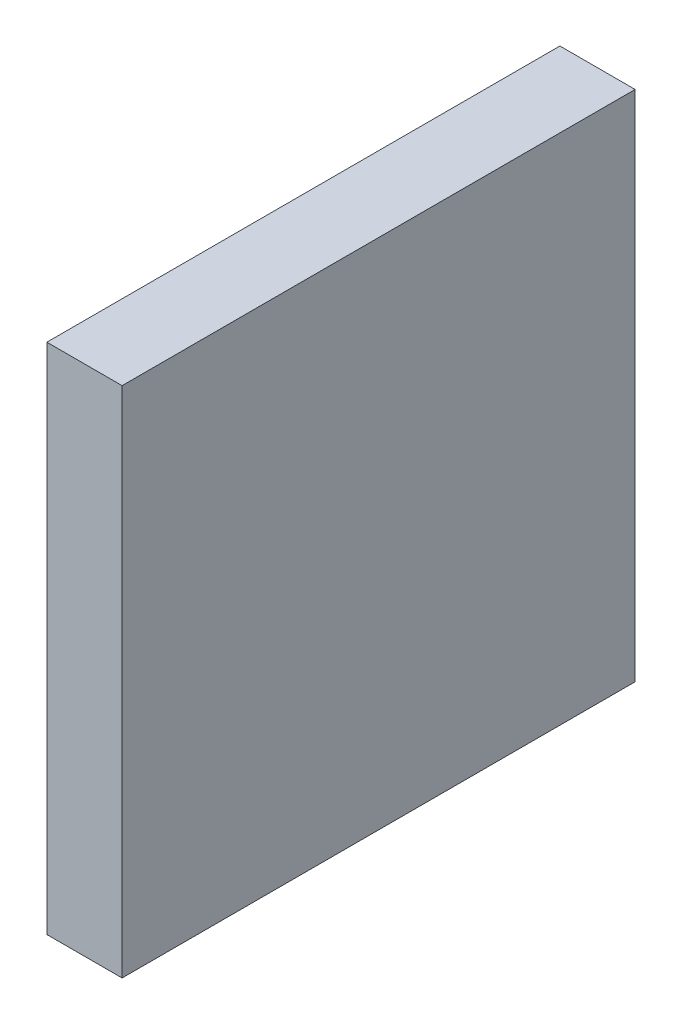
ISO-10303-21;
HEADER;
FILE_DESCRIPTION(('STEP AP214'),'2;1');
FILE_NAME('part.step','',(''),(''),'','','');
FILE_SCHEMA(('AUTOMOTIVE_DESIGN { 1 0 10303 214 1 1 1 1 }'));
ENDSEC;
DATA;
#1=APPLICATION_CONTEXT('core data for automotive mechanical design processes');
#2=APPLICATION_PROTOCOL_DEFINITION('international standard','automotive_design',2000,#1);
#3=PRODUCT_CONTEXT('',#1,'mechanical');
#4=PRODUCT('Part','Part','',(#3));
#5=PRODUCT_RELATED_PRODUCT_CATEGORY('part','',(#4));
#6=PRODUCT_DEFINITION_FORMATION('','',#4);
#7=PRODUCT_DEFINITION_CONTEXT('part definition',#1,'design');
#8=PRODUCT_DEFINITION('design','',#6,#7);
#9=PRODUCT_DEFINITION_SHAPE('','',#8);
#10=(LENGTH_UNIT() NAMED_UNIT(*) SI_UNIT(.MILLI.,.METRE.));
#11=(NAMED_UNIT(*) PLANE_ANGLE_UNIT() SI_UNIT($,.RADIAN.));
#12=(NAMED_UNIT(*) SI_UNIT($,.STERADIAN.) SOLID_ANGLE_UNIT());
#13=UNCERTAINTY_MEASURE_WITH_UNIT(LENGTH_MEASURE(1.E-05),#10,'distance_accuracy_value','');
#14=(GEOMETRIC_REPRESENTATION_CONTEXT(3) GLOBAL_UNCERTAINTY_ASSIGNED_CONTEXT((#13)) GLOBAL_UNIT_ASSIGNED_CONTEXT((#10,
#11,#12)) REPRESENTATION_CONTEXT('',''));
#15=CARTESIAN_POINT('',(0.,0.,0.));
#16=DIRECTION('',(0.,0.,1.));
#17=DIRECTION('',(1.,0.,0.));
#18=AXIS2_PLACEMENT_3D('',#15,#16,#17);
#19=CARTESIAN_POINT('',(-0.01,0.,-121.99));
#20=DIRECTION('',(0.,-1.,0.));
#21=DIRECTION('',(0.,0.,-1.));
#22=AXIS2_PLACEMENT_3D('',#19,#20,#21);
#23=PLANE('',#22);
#24=DIRECTION('',(0.,0.,-1.));
#25=VECTOR('',#24,1.);
#26=CARTESIAN_POINT('',(22.,0.,-197.));
#27=LINE('',#26,#25);
#28=CARTESIAN_POINT('',(22.,0.,-122.));
#29=VERTEX_POINT('',#28);
#30=CARTESIAN_POINT('',(22.,0.,-272.));
#31=VERTEX_POINT('',#30);
#32=EDGE_CURVE('E69',#29,#31,#27,.T.);
#33=ORIENTED_EDGE('',*,*,#32,.F.);
#34=DIRECTION('',(1.,0.,0.));
#35=VECTOR('',#34,1.);
#36=CARTESIAN_POINT('',(11.,0.,-122.));
#37=LINE('',#36,#35);
#38=CARTESIAN_POINT('',(0.,0.,-122.));
#39=VERTEX_POINT('',#38);
#40=EDGE_CURVE('E56',#39,#29,#37,.T.);
#41=ORIENTED_EDGE('',*,*,#40,.F.);
#42=DIRECTION('',(0.,0.,1.));
#43=VECTOR('',#42,1.);
#44=CARTESIAN_POINT('',(0.,0.,-197.));
#45=LINE('',#44,#43);
#46=CARTESIAN_POINT('',(0.,0.,-272.));
#47=VERTEX_POINT('',#46);
#48=EDGE_CURVE('E21',#47,#39,#45,.T.);
#49=ORIENTED_EDGE('',*,*,#48,.F.);
#50=DIRECTION('',(-1.,0.,0.));
#51=VECTOR('',#50,1.);
#52=CARTESIAN_POINT('',(11.,0.,-272.));
#53=LINE('',#52,#51);
#54=EDGE_CURVE('E82',#31,#47,#53,.T.);
#55=ORIENTED_EDGE('',*,*,#54,.F.);
#56=EDGE_LOOP('',(#33,#41,#49,#55));
#57=FACE_BOUND('',#56,.T.);
#58=ADVANCED_FACE('F17',(#57),#23,.T.);
#59=CARTESIAN_POINT('',(0.,-0.0100000000000033,-272.01));
#60=DIRECTION('',(-1.,0.,0.));
#61=DIRECTION('',(0.,0.,1.));
#62=AXIS2_PLACEMENT_3D('',#59,#60,#61);
#63=PLANE('',#62);
#64=DIRECTION('',(0.,1.,0.));
#65=VECTOR('',#64,1.);
#66=CARTESIAN_POINT('',(0.,75.,-272.));
#67=LINE('',#66,#65);
#68=CARTESIAN_POINT('',(0.,150.,-272.));
#69=VERTEX_POINT('',#68);
#70=EDGE_CURVE('E65',#47,#69,#67,.T.);
#71=ORIENTED_EDGE('',*,*,#70,.F.);
#72=ORIENTED_EDGE('',*,*,#48,.T.);
#73=DIRECTION('',(0.,-1.,0.));
#74=VECTOR('',#73,1.);
#75=CARTESIAN_POINT('',(0.,75.,-122.));
#76=LINE('',#75,#74);
#77=CARTESIAN_POINT('',(0.,150.,-122.));
#78=VERTEX_POINT('',#77);
#79=EDGE_CURVE('E62',#78,#39,#76,.T.);
#80=ORIENTED_EDGE('',*,*,#79,.F.);
#81=DIRECTION('',(0.,0.,1.));
#82=VECTOR('',#81,1.);
#83=CARTESIAN_POINT('',(0.,150.,-197.));
#84=LINE('',#83,#82);
#85=EDGE_CURVE('E84',#69,#78,#84,.T.);
#86=ORIENTED_EDGE('',*,*,#85,.F.);
#87=EDGE_LOOP('',(#71,#72,#80,#86));
#88=FACE_BOUND('',#87,.T.);
#89=ADVANCED_FACE('F61',(#88),#63,.T.);
#90=CARTESIAN_POINT('',(-0.01,150.01,-122.));
#91=DIRECTION('',(0.,0.,1.));
#92=DIRECTION('',(0.,-1.,0.));
#93=AXIS2_PLACEMENT_3D('',#90,#91,#92);
#94=PLANE('',#93);
#95=DIRECTION('',(0.,-1.,0.));
#96=VECTOR('',#95,1.);
#97=CARTESIAN_POINT('',(22.,75.,-122.));
#98=LINE('',#97,#96);
#99=CARTESIAN_POINT('',(22.,150.,-122.));
#100=VERTEX_POINT('',#99);
#101=EDGE_CURVE('E71',#100,#29,#98,.T.);
#102=ORIENTED_EDGE('',*,*,#101,.F.);
#103=DIRECTION('',(1.,0.,0.));
#104=VECTOR('',#103,1.);
#105=CARTESIAN_POINT('',(11.,150.,-122.));
#106=LINE('',#105,#104);
#107=EDGE_CURVE('E75',#78,#100,#106,.T.);
#108=ORIENTED_EDGE('',*,*,#107,.F.);
#109=ORIENTED_EDGE('',*,*,#79,.T.);
#110=ORIENTED_EDGE('',*,*,#40,.T.);
#111=EDGE_LOOP('',(#102,#108,#109,#110));
#112=FACE_BOUND('',#111,.T.);
#113=ADVANCED_FACE('F73',(#112),#94,.T.);
#114=CARTESIAN_POINT('',(22.,-0.0100000000000033,-121.99));
#115=DIRECTION('',(1.,0.,0.));
#116=DIRECTION('',(0.,0.,-1.));
#117=AXIS2_PLACEMENT_3D('',#114,#115,#116);
#118=PLANE('',#117);
#119=DIRECTION('',(0.,-1.,0.));
#120=VECTOR('',#119,1.);
#121=CARTESIAN_POINT('',(22.,75.,-272.));
#122=LINE('',#121,#120);
#123=CARTESIAN_POINT('',(22.,150.,-272.));
#124=VERTEX_POINT('',#123);
#125=EDGE_CURVE('E36',#124,#31,#122,.T.);
#126=ORIENTED_EDGE('',*,*,#125,.F.);
#127=DIRECTION('',(0.,0.,-1.));
#128=VECTOR('',#127,1.);
#129=CARTESIAN_POINT('',(22.,150.,-197.));
#130=LINE('',#129,#128);
#131=EDGE_CURVE('E27',#100,#124,#130,.T.);
#132=ORIENTED_EDGE('',*,*,#131,.F.);
#133=ORIENTED_EDGE('',*,*,#101,.T.);
#134=ORIENTED_EDGE('',*,*,#32,.T.);
#135=EDGE_LOOP('',(#126,#132,#133,#134));
#136=FACE_BOUND('',#135,.T.);
#137=ADVANCED_FACE('F89',(#136),#118,.T.);
#138=CARTESIAN_POINT('',(-0.01,-0.01,-272.));
#139=DIRECTION('',(0.,0.,-1.));
#140=DIRECTION('',(0.,1.,0.));
#141=AXIS2_PLACEMENT_3D('',#138,#139,#140);
#142=PLANE('',#141);
#143=ORIENTED_EDGE('',*,*,#125,.T.);
#144=ORIENTED_EDGE('',*,*,#54,.T.);
#145=ORIENTED_EDGE('',*,*,#70,.T.);
#146=DIRECTION('',(-1.,0.,0.));
#147=VECTOR('',#146,1.);
#148=CARTESIAN_POINT('',(11.,150.,-272.));
#149=LINE('',#148,#147);
#150=EDGE_CURVE('E11',#124,#69,#149,.T.);
#151=ORIENTED_EDGE('',*,*,#150,.F.);
#152=EDGE_LOOP('',(#143,#144,#145,#151));
#153=FACE_BOUND('',#152,.T.);
#154=ADVANCED_FACE('F91',(#153),#142,.T.);
#155=CARTESIAN_POINT('',(-0.01,150.,-272.01));
#156=DIRECTION('',(0.,1.,0.));
#157=DIRECTION('',(0.,0.,1.));
#158=AXIS2_PLACEMENT_3D('',#155,#156,#157);
#159=PLANE('',#158);
#160=ORIENTED_EDGE('',*,*,#131,.T.);
#161=ORIENTED_EDGE('',*,*,#150,.T.);
#162=ORIENTED_EDGE('',*,*,#85,.T.);
#163=ORIENTED_EDGE('',*,*,#107,.T.);
#164=EDGE_LOOP('',(#160,#161,#162,#163));
#165=FACE_BOUND('',#164,.T.);
#166=ADVANCED_FACE('F19',(#165),#159,.T.);
#167=CLOSED_SHELL('',(#58,#89,#113,#137,#154,#166));
#168=MANIFOLD_SOLID_BREP('B1',#167);
#169=ADVANCED_BREP_SHAPE_REPRESENTATION('',(#18,#168),#14);
#170=SHAPE_DEFINITION_REPRESENTATION(#9,#169);
ENDSEC;
END-ISO-10303-21;
